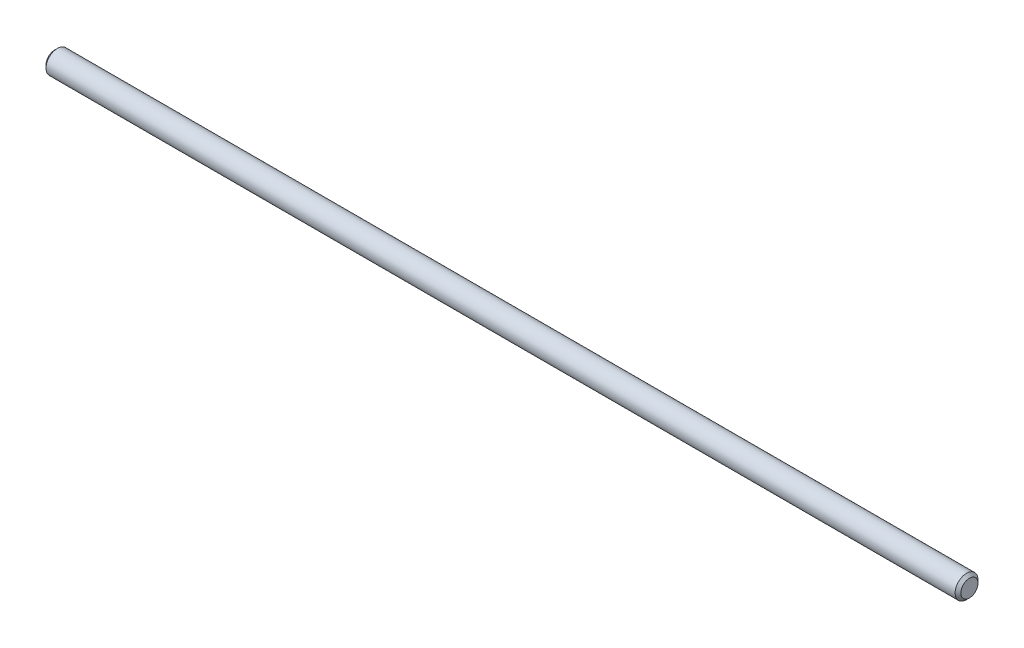
ISO-10303-21;
HEADER;
FILE_DESCRIPTION(('STEP AP214'),'2;1');
FILE_NAME('part.step','',(''),(''),'','','');
FILE_SCHEMA(('AUTOMOTIVE_DESIGN { 1 0 10303 214 1 1 1 1 }'));
ENDSEC;
DATA;
#1=APPLICATION_CONTEXT('core data for automotive mechanical design processes');
#2=APPLICATION_PROTOCOL_DEFINITION('international standard','automotive_design',2000,#1);
#3=PRODUCT_CONTEXT('',#1,'mechanical');
#4=PRODUCT('Part','Part','',(#3));
#5=PRODUCT_RELATED_PRODUCT_CATEGORY('part','',(#4));
#6=PRODUCT_DEFINITION_FORMATION('','',#4);
#7=PRODUCT_DEFINITION_CONTEXT('part definition',#1,'design');
#8=PRODUCT_DEFINITION('design','',#6,#7);
#9=PRODUCT_DEFINITION_SHAPE('','',#8);
#10=(LENGTH_UNIT() NAMED_UNIT(*) SI_UNIT(.MILLI.,.METRE.));
#11=(NAMED_UNIT(*) PLANE_ANGLE_UNIT() SI_UNIT($,.RADIAN.));
#12=(NAMED_UNIT(*) SI_UNIT($,.STERADIAN.) SOLID_ANGLE_UNIT());
#13=UNCERTAINTY_MEASURE_WITH_UNIT(LENGTH_MEASURE(1.E-05),#10,'distance_accuracy_value','');
#14=(GEOMETRIC_REPRESENTATION_CONTEXT(3) GLOBAL_UNCERTAINTY_ASSIGNED_CONTEXT((#13)) GLOBAL_UNIT_ASSIGNED_CONTEXT((#10,
#11,#12)) REPRESENTATION_CONTEXT('',''));
#15=CARTESIAN_POINT('',(0.,0.,0.));
#16=DIRECTION('',(0.,0.,1.));
#17=DIRECTION('',(1.,0.,0.));
#18=AXIS2_PLACEMENT_3D('',#15,#16,#17);
#19=CARTESIAN_POINT('',(80.,0.,0.));
#20=DIRECTION('',(-1.,0.,0.));
#21=DIRECTION('',(0.,0.,1.));
#22=AXIS2_PLACEMENT_3D('',#19,#20,#21);
#23=CYLINDRICAL_SURFACE('',#22,2.);
#24=CARTESIAN_POINT('',(79.5,0.,0.));
#25=DIRECTION('',(1.,0.,0.));
#26=DIRECTION('',(0.,0.,-1.));
#27=AXIS2_PLACEMENT_3D('',#24,#25,#26);
#28=CIRCLE('',#27,2.);
#29=CARTESIAN_POINT('',(79.5,0.,-2.));
#30=VERTEX_POINT('',#29);
#31=EDGE_CURVE('E49',#30,#30,#28,.F.);
#32=ORIENTED_EDGE('',*,*,#31,.T.);
#33=EDGE_LOOP('',(#32));
#34=FACE_BOUND('',#33,.T.);
#35=CARTESIAN_POINT('',(-79.5,0.,0.));
#36=DIRECTION('',(1.,0.,0.));
#37=DIRECTION('',(0.,0.,-1.));
#38=AXIS2_PLACEMENT_3D('',#35,#36,#37);
#39=CIRCLE('',#38,2.);
#40=CARTESIAN_POINT('',(-79.5,0.,-2.));
#41=VERTEX_POINT('',#40);
#42=EDGE_CURVE('E54',#41,#41,#39,.T.);
#43=ORIENTED_EDGE('',*,*,#42,.T.);
#44=EDGE_LOOP('',(#43));
#45=FACE_BOUND('',#44,.T.);
#46=ADVANCED_FACE('F41',(#34,#45),#23,.T.);
#47=CARTESIAN_POINT('',(80.,0.,0.));
#48=DIRECTION('',(1.,0.,0.));
#49=DIRECTION('',(0.,0.,-1.));
#50=AXIS2_PLACEMENT_3D('',#47,#48,#49);
#51=PLANE('',#50);
#52=CARTESIAN_POINT('',(80.,0.,0.));
#53=DIRECTION('',(1.,0.,0.));
#54=DIRECTION('',(0.,0.,-1.));
#55=AXIS2_PLACEMENT_3D('',#52,#53,#54);
#56=CIRCLE('',#55,1.5);
#57=CARTESIAN_POINT('',(80.,0.,-1.5));
#58=VERTEX_POINT('',#57);
#59=EDGE_CURVE('E59',#58,#58,#56,.T.);
#60=ORIENTED_EDGE('',*,*,#59,.T.);
#61=EDGE_LOOP('',(#60));
#62=FACE_BOUND('',#61,.T.);
#63=ADVANCED_FACE('F66',(#62),#51,.T.);
#64=CARTESIAN_POINT('',(-80.,0.,0.));
#65=DIRECTION('',(1.,0.,0.));
#66=DIRECTION('',(0.,0.,-1.));
#67=AXIS2_PLACEMENT_3D('',#64,#65,#66);
#68=PLANE('',#67);
#69=CARTESIAN_POINT('',(-80.,0.,0.));
#70=DIRECTION('',(1.,0.,0.));
#71=DIRECTION('',(0.,0.,-1.));
#72=AXIS2_PLACEMENT_3D('',#69,#70,#71);
#73=CIRCLE('',#72,1.49999999999996);
#74=CARTESIAN_POINT('',(-80.,0.,-1.49999999999996));
#75=VERTEX_POINT('',#74);
#76=EDGE_CURVE('E10',#75,#75,#73,.F.);
#77=ORIENTED_EDGE('',*,*,#76,.T.);
#78=EDGE_LOOP('',(#77));
#79=FACE_BOUND('',#78,.T.);
#80=ADVANCED_FACE('F70',(#79),#68,.F.);
#81=CARTESIAN_POINT('',(80.,0.,0.));
#82=DIRECTION('',(-1.,0.,0.));
#83=DIRECTION('',(0.,0.,1.));
#84=AXIS2_PLACEMENT_3D('',#81,#82,#83);
#85=CONICAL_SURFACE('',#84,1.5,0.785398163397432);
#86=ORIENTED_EDGE('',*,*,#31,.F.);
#87=EDGE_LOOP('',(#86));
#88=FACE_BOUND('',#87,.T.);
#89=ORIENTED_EDGE('',*,*,#59,.F.);
#90=EDGE_LOOP('',(#89));
#91=FACE_BOUND('',#90,.T.);
#92=ADVANCED_FACE('F68',(#88,#91),#85,.T.);
#93=CARTESIAN_POINT('',(-79.5,0.,0.));
#94=DIRECTION('',(1.,0.,0.));
#95=DIRECTION('',(0.,0.,-1.));
#96=AXIS2_PLACEMENT_3D('',#93,#94,#95);
#97=CONICAL_SURFACE('',#96,2.,0.78539816339746);
#98=ORIENTED_EDGE('',*,*,#76,.F.);
#99=EDGE_LOOP('',(#98));
#100=FACE_BOUND('',#99,.T.);
#101=ORIENTED_EDGE('',*,*,#42,.F.);
#102=EDGE_LOOP('',(#101));
#103=FACE_BOUND('',#102,.T.);
#104=ADVANCED_FACE('F43',(#100,#103),#97,.T.);
#105=CLOSED_SHELL('',(#46,#63,#80,#92,#104));
#106=MANIFOLD_SOLID_BREP('B2',#105);
#107=ADVANCED_BREP_SHAPE_REPRESENTATION('',(#18,#106),#14);
#108=SHAPE_DEFINITION_REPRESENTATION(#9,#107);
ENDSEC;
END-ISO-10303-21;
